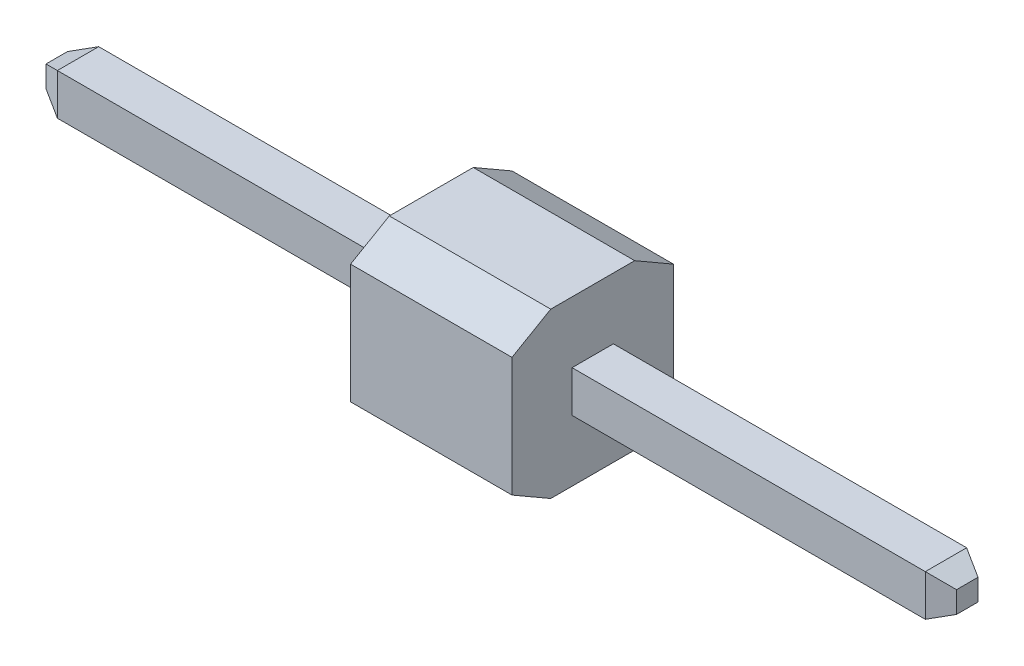
ISO-10303-21;
HEADER;
FILE_DESCRIPTION(('STEP AP214'),'2;1');
FILE_NAME('part.step','',(''),(''),'','','');
FILE_SCHEMA(('AUTOMOTIVE_DESIGN { 1 0 10303 214 1 1 1 1 }'));
ENDSEC;
DATA;
#1=APPLICATION_CONTEXT('core data for automotive mechanical design processes');
#2=APPLICATION_PROTOCOL_DEFINITION('international standard','automotive_design',2000,#1);
#3=PRODUCT_CONTEXT('',#1,'mechanical');
#4=PRODUCT('Part','Part','',(#3));
#5=PRODUCT_RELATED_PRODUCT_CATEGORY('part','',(#4));
#6=PRODUCT_DEFINITION_FORMATION('','',#4);
#7=PRODUCT_DEFINITION_CONTEXT('part definition',#1,'design');
#8=PRODUCT_DEFINITION('design','',#6,#7);
#9=PRODUCT_DEFINITION_SHAPE('','',#8);
#10=(LENGTH_UNIT() NAMED_UNIT(*) SI_UNIT(.MILLI.,.METRE.));
#11=(NAMED_UNIT(*) PLANE_ANGLE_UNIT() SI_UNIT($,.RADIAN.));
#12=(NAMED_UNIT(*) SI_UNIT($,.STERADIAN.) SOLID_ANGLE_UNIT());
#13=UNCERTAINTY_MEASURE_WITH_UNIT(LENGTH_MEASURE(1.E-05),#10,'distance_accuracy_value','');
#14=(GEOMETRIC_REPRESENTATION_CONTEXT(3) GLOBAL_UNCERTAINTY_ASSIGNED_CONTEXT((#13)) GLOBAL_UNIT_ASSIGNED_CONTEXT((#10,
#11,#12)) REPRESENTATION_CONTEXT('',''));
#15=CARTESIAN_POINT('',(0.,0.,0.));
#16=DIRECTION('',(0.,0.,1.));
#17=DIRECTION('',(1.,0.,0.));
#18=AXIS2_PLACEMENT_3D('',#15,#16,#17);
#19=CARTESIAN_POINT('',(5.42107514744054,-4.76288427394286,-2.77112015145706));
#20=DIRECTION('',(1.,-9.93476518829084E-08,4.37113882867379E-08));
#21=DIRECTION('',(-9.93476589883358E-08,-1.,8.74227765734759E-08));
#22=AXIS2_PLACEMENT_3D('',#19,#20,#21);
#23=PLANE('',#22);
#24=DIRECTION('',(-1.18186632778994E-08,-0.500000075710537,-0.866025360072935));
#25=VECTOR('',#24,1.);
#26=CARTESIAN_POINT('',(5.42107495526593,-6.00647397517509,-1.20112004273899));
#27=LINE('',#26,#25);
#28=CARTESIAN_POINT('',(5.42107495526593,-6.00647397517509,-1.20112004273899));
#29=VERTEX_POINT('',#28);
#30=CARTESIAN_POINT('',(5.42107494707772,-6.35288418914276,-1.80112001245485));
#31=VERTEX_POINT('',#30);
#32=EDGE_CURVE('E11',#29,#31,#27,.T.);
#33=ORIENTED_EDGE('',*,*,#32,.T.);
#34=DIRECTION('',(4.37113811813104E-08,-8.74227835422599E-08,-0.999999999999995));
#35=VECTOR('',#34,1.);
#36=CARTESIAN_POINT('',(5.42107494707772,-6.35288418914276,-1.80112001245485));
#37=LINE('',#36,#35);
#38=CARTESIAN_POINT('',(5.42107500390252,-6.35288430279238,-3.10112001245485));
#39=VERTEX_POINT('',#38);
#40=EDGE_CURVE('E304',#31,#39,#37,.T.);
#41=ORIENTED_EDGE('',*,*,#40,.T.);
#42=DIRECTION('',(8.75289963529268E-08,0.499999924289836,-0.866025447495713));
#43=VECTOR('',#42,1.);
#44=CARTESIAN_POINT('',(5.42107500390252,-6.35288430279238,-3.10112001245485));
#45=LINE('',#44,#43);
#46=CARTESIAN_POINT('',(5.42107506454438,-6.00647419373205,-3.70112004273898));
#47=VERTEX_POINT('',#46);
#48=EDGE_CURVE('E296',#39,#47,#45,.T.);
#49=ORIENTED_EDGE('',*,*,#48,.T.);
#50=DIRECTION('',(9.93476588435403E-08,0.999999999999991,-8.74227767225989E-08));
#51=VECTOR('',#50,1.);
#52=CARTESIAN_POINT('',(5.42107506454438,-6.00647419373205,-3.70112004273898));
#53=LINE('',#52,#51);
#54=CARTESIAN_POINT('',(5.42107524805736,-4.15929451676005,-3.70112020422456));
#55=VERTEX_POINT('',#54);
#56=EDGE_CURVE('E281',#47,#55,#53,.T.);
#57=ORIENTED_EDGE('',*,*,#56,.T.);
#58=DIRECTION('',(-1.18186632778994E-08,-0.500000075710538,-0.866025360072935));
#59=VECTOR('',#58,1.);
#60=CARTESIAN_POINT('',(5.42107525624557,-3.81288430279238,-3.1011202345087));
#61=LINE('',#60,#59);
#62=CARTESIAN_POINT('',(5.42107525624557,-3.81288430279238,-3.1011202345087));
#63=VERTEX_POINT('',#62);
#64=EDGE_CURVE('E265',#63,#55,#61,.T.);
#65=ORIENTED_EDGE('',*,*,#64,.F.);
#66=DIRECTION('',(4.37113811813104E-08,-8.74227828590458E-08,-0.999999999999995));
#67=VECTOR('',#66,1.);
#68=CARTESIAN_POINT('',(5.42107519942078,-3.81288418914276,-1.8011202345087));
#69=LINE('',#68,#67);
#70=CARTESIAN_POINT('',(5.42107519942078,-3.81288418914276,-1.8011202345087));
#71=VERTEX_POINT('',#70);
#72=EDGE_CURVE('E248',#71,#63,#69,.T.);
#73=ORIENTED_EDGE('',*,*,#72,.F.);
#74=DIRECTION('',(8.75289963529269E-08,0.499999924289835,-0.866025447495714));
#75=VECTOR('',#74,1.);
#76=CARTESIAN_POINT('',(5.42107513877891,-4.15929429820309,-1.20112020422456));
#77=LINE('',#76,#75);
#78=CARTESIAN_POINT('',(5.42107513877891,-4.15929429820309,-1.20112020422456));
#79=VERTEX_POINT('',#78);
#80=EDGE_CURVE('E242',#79,#71,#77,.T.);
#81=ORIENTED_EDGE('',*,*,#80,.F.);
#82=DIRECTION('',(9.93476588435403E-08,0.999999999999991,-8.74227763619768E-08));
#83=VECTOR('',#82,1.);
#84=CARTESIAN_POINT('',(5.42107495526593,-6.00647397517509,-1.20112004273899));
#85=LINE('',#84,#83);
#86=EDGE_CURVE('E236',#29,#79,#85,.T.);
#87=ORIENTED_EDGE('',*,*,#86,.F.);
#88=EDGE_LOOP('',(#33,#41,#49,#57,#65,#73,#81,#87));
#89=FACE_BOUND('',#88,.T.);
#90=DIRECTION('',(-4.37113817364219E-08,8.74227842895255E-08,0.999999999999995));
#91=VECTOR('',#90,1.);
#92=CARTESIAN_POINT('',(5.42107508385804,-5.40288427394286,-2.77112009550648));
#93=LINE('',#92,#91);
#94=CARTESIAN_POINT('',(5.42107508385804,-5.40288427394286,-2.77112009550648));
#95=VERTEX_POINT('',#94);
#96=CARTESIAN_POINT('',(5.42107505588275,-5.40288421799228,-2.13112009550648));
#97=VERTEX_POINT('',#96);
#98=EDGE_CURVE('E302',#95,#97,#93,.T.);
#99=ORIENTED_EDGE('',*,*,#98,.T.);
#100=DIRECTION('',(-9.93476592658907E-08,-0.999999999999991,8.74227759628525E-08));
#101=VECTOR('',#100,1.);
#102=CARTESIAN_POINT('',(5.42107511946525,-4.76288421799228,-2.13112015145706));
#103=LINE('',#102,#101);
#104=CARTESIAN_POINT('',(5.42107511946525,-4.76288421799228,-2.13112015145706));
#105=VERTEX_POINT('',#104);
#106=EDGE_CURVE('E293',#105,#97,#103,.T.);
#107=ORIENTED_EDGE('',*,*,#106,.F.);
#108=DIRECTION('',(-4.37113803486431E-08,8.74227842895254E-08,0.999999999999995));
#109=VECTOR('',#108,1.);
#110=CARTESIAN_POINT('',(5.42107514744054,-4.76288427394286,-2.77112015145706));
#111=LINE('',#110,#109);
#112=CARTESIAN_POINT('',(5.42107514744054,-4.76288427394286,-2.77112015145706));
#113=VERTEX_POINT('',#112);
#114=EDGE_CURVE('E278',#113,#105,#111,.T.);
#115=ORIENTED_EDGE('',*,*,#114,.F.);
#116=DIRECTION('',(-9.93476578781119E-08,-0.999999999999991,8.74227766567419E-08));
#117=VECTOR('',#116,1.);
#118=CARTESIAN_POINT('',(5.42107514744054,-4.76288427394286,-2.77112015145706));
#119=LINE('',#118,#117);
#120=EDGE_CURVE('E263',#113,#95,#119,.T.);
#121=ORIENTED_EDGE('',*,*,#120,.T.);
#122=EDGE_LOOP('',(#99,#107,#115,#121));
#123=FACE_BOUND('',#122,.T.);
#124=ADVANCED_FACE('F17',(#89,#123),#23,.T.);
#125=CARTESIAN_POINT('',(2.92107514744054,-4.76288402557373,-2.77112026073553));
#126=DIRECTION('',(1.,-9.93476518829084E-08,4.37113882867379E-08));
#127=DIRECTION('',(-9.93476589883358E-08,-1.,8.74227765734759E-08));
#128=AXIS2_PLACEMENT_3D('',#125,#126,#127);
#129=PLANE('',#128);
#130=DIRECTION('',(-1.18186626369119E-08,-0.500000075710537,-0.866025360072935));
#131=VECTOR('',#130,1.);
#132=CARTESIAN_POINT('',(2.92107495526593,-6.00647372680596,-1.20112015201746));
#133=LINE('',#132,#131);
#134=CARTESIAN_POINT('',(2.92107495526593,-6.00647372680596,-1.20112015201746));
#135=VERTEX_POINT('',#134);
#136=CARTESIAN_POINT('',(2.92107494707772,-6.35288394077363,-1.80112012173332));
#137=VERTEX_POINT('',#136);
#138=EDGE_CURVE('E24',#135,#137,#133,.T.);
#139=ORIENTED_EDGE('',*,*,#138,.F.);
#140=DIRECTION('',(9.9347659083955E-08,0.999999999999991,-8.74227763619768E-08));
#141=VECTOR('',#140,1.);
#142=CARTESIAN_POINT('',(2.92107495526593,-6.00647372680596,-1.20112015201746));
#143=LINE('',#142,#141);
#144=CARTESIAN_POINT('',(2.92107513877891,-4.15929404983396,-1.20112031350303));
#145=VERTEX_POINT('',#144);
#146=EDGE_CURVE('E300',#135,#145,#143,.T.);
#147=ORIENTED_EDGE('',*,*,#146,.T.);
#148=DIRECTION('',(8.75289957119393E-08,0.499999924289835,-0.866025447495714));
#149=VECTOR('',#148,1.);
#150=CARTESIAN_POINT('',(2.92107513877891,-4.15929404983396,-1.20112031350303));
#151=LINE('',#150,#149);
#152=CARTESIAN_POINT('',(2.92107519942077,-3.81288394077363,-1.80112034378717));
#153=VERTEX_POINT('',#152);
#154=EDGE_CURVE('E286',#145,#153,#151,.T.);
#155=ORIENTED_EDGE('',*,*,#154,.T.);
#156=DIRECTION('',(4.37113811813104E-08,-8.74227828590458E-08,-0.999999999999995));
#157=VECTOR('',#156,1.);
#158=CARTESIAN_POINT('',(2.92107519942077,-3.81288394077363,-1.80112034378717));
#159=LINE('',#158,#157);
#160=CARTESIAN_POINT('',(2.92107525624557,-3.81288405442325,-3.10112034378717));
#161=VERTEX_POINT('',#160);
#162=EDGE_CURVE('E271',#153,#161,#159,.T.);
#163=ORIENTED_EDGE('',*,*,#162,.T.);
#164=DIRECTION('',(-1.18186626369119E-08,-0.500000075710538,-0.866025360072935));
#165=VECTOR('',#164,1.);
#166=CARTESIAN_POINT('',(2.92107525624557,-3.81288405442325,-3.10112034378717));
#167=LINE('',#166,#165);
#168=CARTESIAN_POINT('',(2.92107524805736,-4.15929426839092,-3.70112031350303));
#169=VERTEX_POINT('',#168);
#170=EDGE_CURVE('E253',#161,#169,#167,.T.);
#171=ORIENTED_EDGE('',*,*,#170,.T.);
#172=DIRECTION('',(9.9347659083955E-08,0.999999999999991,-8.74227767225989E-08));
#173=VECTOR('',#172,1.);
#174=CARTESIAN_POINT('',(2.92107506454438,-6.00647394536292,-3.70112015201746));
#175=LINE('',#174,#173);
#176=CARTESIAN_POINT('',(2.92107506454438,-6.00647394536292,-3.70112015201746));
#177=VERTEX_POINT('',#176);
#178=EDGE_CURVE('E261',#177,#169,#175,.T.);
#179=ORIENTED_EDGE('',*,*,#178,.F.);
#180=DIRECTION('',(8.75289957119392E-08,0.499999924289836,-0.866025447495713));
#181=VECTOR('',#180,1.);
#182=CARTESIAN_POINT('',(2.92107500390252,-6.35288405442325,-3.10112012173332));
#183=LINE('',#182,#181);
#184=CARTESIAN_POINT('',(2.92107500390252,-6.35288405442325,-3.10112012173332));
#185=VERTEX_POINT('',#184);
#186=EDGE_CURVE('E276',#185,#177,#183,.T.);
#187=ORIENTED_EDGE('',*,*,#186,.F.);
#188=DIRECTION('',(4.37113811813104E-08,-8.74227835422599E-08,-0.999999999999995));
#189=VECTOR('',#188,1.);
#190=CARTESIAN_POINT('',(2.92107494707772,-6.35288394077363,-1.80112012173332));
#191=LINE('',#190,#189);
#192=EDGE_CURVE('E291',#137,#185,#191,.T.);
#193=ORIENTED_EDGE('',*,*,#192,.F.);
#194=EDGE_LOOP('',(#139,#147,#155,#163,#171,#179,#187,#193));
#195=FACE_BOUND('',#194,.T.);
#196=DIRECTION('',(-9.93476592658907E-08,-0.999999999999991,8.74227759628525E-08));
#197=VECTOR('',#196,1.);
#198=CARTESIAN_POINT('',(2.92107511946525,-4.76288396962315,-2.13112026073553));
#199=LINE('',#198,#197);
#200=CARTESIAN_POINT('',(2.92107511946525,-4.76288396962315,-2.13112026073553));
#201=VERTEX_POINT('',#200);
#202=CARTESIAN_POINT('',(2.92107505588275,-5.40288396962315,-2.13112020478496));
#203=VERTEX_POINT('',#202);
#204=EDGE_CURVE('E298',#201,#203,#199,.T.);
#205=ORIENTED_EDGE('',*,*,#204,.T.);
#206=DIRECTION('',(-4.37113810425325E-08,8.74227842895255E-08,0.999999999999995));
#207=VECTOR('',#206,1.);
#208=CARTESIAN_POINT('',(2.92107508385804,-5.40288402557373,-2.77112020478496));
#209=LINE('',#208,#207);
#210=CARTESIAN_POINT('',(2.92107508385804,-5.40288402557373,-2.77112020478496));
#211=VERTEX_POINT('',#210);
#212=EDGE_CURVE('E283',#211,#203,#209,.T.);
#213=ORIENTED_EDGE('',*,*,#212,.F.);
#214=DIRECTION('',(-9.93476592658907E-08,-0.999999999999991,8.74227766567419E-08));
#215=VECTOR('',#214,1.);
#216=CARTESIAN_POINT('',(2.92107514744054,-4.76288402557373,-2.77112026073553));
#217=LINE('',#216,#215);
#218=CARTESIAN_POINT('',(2.92107514744054,-4.76288402557373,-2.77112026073553));
#219=VERTEX_POINT('',#218);
#220=EDGE_CURVE('E268',#219,#211,#217,.T.);
#221=ORIENTED_EDGE('',*,*,#220,.F.);
#222=DIRECTION('',(-4.37113810425325E-08,8.74227842895254E-08,0.999999999999995));
#223=VECTOR('',#222,1.);
#224=CARTESIAN_POINT('',(2.92107514744054,-4.76288402557373,-2.77112026073553));
#225=LINE('',#224,#223);
#226=EDGE_CURVE('E251',#219,#201,#225,.T.);
#227=ORIENTED_EDGE('',*,*,#226,.T.);
#228=EDGE_LOOP('',(#205,#213,#221,#227));
#229=FACE_BOUND('',#228,.T.);
#230=ADVANCED_FACE('F314',(#195,#229),#129,.F.);
#231=CARTESIAN_POINT('',(5.42107495526593,-6.00647397517509,-1.20112004273899));
#232=DIRECTION('',(1.07893287081065E-07,0.866025360072937,-0.500000075710535));
#233=DIRECTION('',(1.18186629566715E-08,0.500000075710542,0.866025360072941));
#234=AXIS2_PLACEMENT_3D('',#231,#232,#233);
#235=PLANE('',#234);
#236=ORIENTED_EDGE('',*,*,#138,.T.);
#237=DIRECTION('',(-0.999999999999994,9.93476522381792E-08,-4.37113884643734E-08));
#238=VECTOR('',#237,1.);
#239=CARTESIAN_POINT('',(5.42107494707772,-6.35288418914276,-1.80112001245485));
#240=LINE('',#239,#238);
#241=EDGE_CURVE('E288',#31,#137,#240,.T.);
#242=ORIENTED_EDGE('',*,*,#241,.F.);
#243=ORIENTED_EDGE('',*,*,#32,.F.);
#244=DIRECTION('',(-0.999999999999994,9.93476525934505E-08,-4.3711388109102E-08));
#245=VECTOR('',#244,1.);
#246=CARTESIAN_POINT('',(5.42107495526593,-6.00647397517509,-1.20112004273899));
#247=LINE('',#246,#245);
#248=EDGE_CURVE('E256',#29,#135,#247,.T.);
#249=ORIENTED_EDGE('',*,*,#248,.T.);
#250=EDGE_LOOP('',(#236,#242,#243,#249));
#251=FACE_BOUND('',#250,.T.);
#252=ADVANCED_FACE('F306',(#251),#235,.F.);
#253=CARTESIAN_POINT('',(5.42107494707772,-6.35288418914276,-1.80112001245485));
#254=DIRECTION('',(9.93476589883358E-08,1.,-8.74227765734759E-08));
#255=DIRECTION('',(1.,-9.93476518829084E-08,4.37113882867379E-08));
#256=AXIS2_PLACEMENT_3D('',#253,#254,#255);
#257=PLANE('',#256);
#258=ORIENTED_EDGE('',*,*,#192,.T.);
#259=DIRECTION('',(-0.999999999999994,9.93476522381792E-08,-4.37113882867377E-08));
#260=VECTOR('',#259,1.);
#261=CARTESIAN_POINT('',(5.42107500390252,-6.35288430279238,-3.10112001245485));
#262=LINE('',#261,#260);
#263=EDGE_CURVE('E273',#39,#185,#262,.T.);
#264=ORIENTED_EDGE('',*,*,#263,.F.);
#265=ORIENTED_EDGE('',*,*,#40,.F.);
#266=ORIENTED_EDGE('',*,*,#241,.T.);
#267=EDGE_LOOP('',(#258,#264,#265,#266));
#268=FACE_BOUND('',#267,.T.);
#269=ADVANCED_FACE('F311',(#268),#257,.F.);
#270=CARTESIAN_POINT('',(5.42107500390252,-6.35288430279238,-3.10112001245485));
#271=DIRECTION('',(6.41819058997377E-08,0.866025447495721,0.499999924289845));
#272=DIRECTION('',(-8.7528996031702E-08,-0.499999924289838,0.866025447495717));
#273=AXIS2_PLACEMENT_3D('',#270,#271,#272);
#274=PLANE('',#273);
#275=ORIENTED_EDGE('',*,*,#186,.T.);
#276=DIRECTION('',(-0.999999999999994,9.93476525934505E-08,-4.37113884643734E-08));
#277=VECTOR('',#276,1.);
#278=CARTESIAN_POINT('',(5.42107506454438,-6.00647419373205,-3.70112004273898));
#279=LINE('',#278,#277);
#280=EDGE_CURVE('E258',#47,#177,#279,.T.);
#281=ORIENTED_EDGE('',*,*,#280,.F.);
#282=ORIENTED_EDGE('',*,*,#48,.F.);
#283=ORIENTED_EDGE('',*,*,#263,.T.);
#284=EDGE_LOOP('',(#275,#281,#282,#283));
#285=FACE_BOUND('',#284,.T.);
#286=ADVANCED_FACE('F319',(#285),#274,.F.);
#287=CARTESIAN_POINT('',(5.42107506454438,-6.00647419373205,-3.70112004273898));
#288=DIRECTION('',(-4.37113811813106E-08,8.74227836789032E-08,1.));
#289=DIRECTION('',(-1.,9.93476518829084E-08,-4.37113882867379E-08));
#290=AXIS2_PLACEMENT_3D('',#287,#288,#289);
#291=PLANE('',#290);
#292=ORIENTED_EDGE('',*,*,#178,.T.);
#293=DIRECTION('',(-0.999999999999994,9.93476518829078E-08,-4.37113882867377E-08));
#294=VECTOR('',#293,1.);
#295=CARTESIAN_POINT('',(5.42107524805736,-4.15929451676005,-3.70112020422456));
#296=LINE('',#295,#294);
#297=EDGE_CURVE('E245',#55,#169,#296,.T.);
#298=ORIENTED_EDGE('',*,*,#297,.F.);
#299=ORIENTED_EDGE('',*,*,#56,.F.);
#300=ORIENTED_EDGE('',*,*,#280,.T.);
#301=EDGE_LOOP('',(#292,#298,#299,#300));
#302=FACE_BOUND('',#301,.T.);
#303=ADVANCED_FACE('F326',(#302),#291,.F.);
#304=CARTESIAN_POINT('',(5.42107525624557,-3.81288430279238,-3.1011202345087));
#305=DIRECTION('',(1.07893287081065E-07,0.866025360072937,-0.500000075710535));
#306=DIRECTION('',(1.18186629566715E-08,0.500000075710542,0.866025360072941));
#307=AXIS2_PLACEMENT_3D('',#304,#305,#306);
#308=PLANE('',#307);
#309=ORIENTED_EDGE('',*,*,#170,.F.);
#310=DIRECTION('',(-0.999999999999994,9.93476518829078E-08,-4.37113884643734E-08));
#311=VECTOR('',#310,1.);
#312=CARTESIAN_POINT('',(5.42107525624557,-3.81288430279238,-3.1011202345087));
#313=LINE('',#312,#311);
#314=EDGE_CURVE('E239',#63,#161,#313,.T.);
#315=ORIENTED_EDGE('',*,*,#314,.F.);
#316=ORIENTED_EDGE('',*,*,#64,.T.);
#317=ORIENTED_EDGE('',*,*,#297,.T.);
#318=EDGE_LOOP('',(#309,#315,#316,#317));
#319=FACE_BOUND('',#318,.T.);
#320=ADVANCED_FACE('F329',(#319),#308,.T.);
#321=CARTESIAN_POINT('',(5.42107519942078,-3.81288418914276,-1.8011202345087));
#322=DIRECTION('',(9.93476589883358E-08,1.,-8.74227765734759E-08));
#323=DIRECTION('',(1.,-9.93476518829084E-08,4.37113882867379E-08));
#324=AXIS2_PLACEMENT_3D('',#321,#322,#323);
#325=PLANE('',#324);
#326=ORIENTED_EDGE('',*,*,#162,.F.);
#327=DIRECTION('',(-0.999999999999994,9.93476518829078E-08,-4.37113883755555E-08));
#328=VECTOR('',#327,1.);
#329=CARTESIAN_POINT('',(5.42107519942078,-3.81288418914276,-1.8011202345087));
#330=LINE('',#329,#328);
#331=EDGE_CURVE('E233',#71,#153,#330,.T.);
#332=ORIENTED_EDGE('',*,*,#331,.F.);
#333=ORIENTED_EDGE('',*,*,#72,.T.);
#334=ORIENTED_EDGE('',*,*,#314,.T.);
#335=EDGE_LOOP('',(#326,#332,#333,#334));
#336=FACE_BOUND('',#335,.T.);
#337=ADVANCED_FACE('F333',(#336),#325,.T.);
#338=CARTESIAN_POINT('',(5.42107513877891,-4.15929429820309,-1.20112020422456));
#339=DIRECTION('',(6.41819058997377E-08,0.866025447495721,0.499999924289845));
#340=DIRECTION('',(-8.7528996031702E-08,-0.499999924289838,0.866025447495717));
#341=AXIS2_PLACEMENT_3D('',#338,#339,#340);
#342=PLANE('',#341);
#343=ORIENTED_EDGE('',*,*,#154,.F.);
#344=DIRECTION('',(-0.999999999999994,9.93476518829078E-08,-4.3711388109102E-08));
#345=VECTOR('',#344,1.);
#346=CARTESIAN_POINT('',(5.42107513877891,-4.15929429820309,-1.20112020422456));
#347=LINE('',#346,#345);
#348=EDGE_CURVE('E230',#79,#145,#347,.T.);
#349=ORIENTED_EDGE('',*,*,#348,.F.);
#350=ORIENTED_EDGE('',*,*,#80,.T.);
#351=ORIENTED_EDGE('',*,*,#331,.T.);
#352=EDGE_LOOP('',(#343,#349,#350,#351));
#353=FACE_BOUND('',#352,.T.);
#354=ADVANCED_FACE('F337',(#353),#342,.T.);
#355=CARTESIAN_POINT('',(5.42107495526593,-6.00647397517509,-1.20112004273899));
#356=DIRECTION('',(-4.37113811813106E-08,8.74227835615132E-08,1.));
#357=DIRECTION('',(-9.93476589883358E-08,-1.,8.74227764560859E-08));
#358=AXIS2_PLACEMENT_3D('',#355,#356,#357);
#359=PLANE('',#358);
#360=ORIENTED_EDGE('',*,*,#146,.F.);
#361=ORIENTED_EDGE('',*,*,#248,.F.);
#362=ORIENTED_EDGE('',*,*,#86,.T.);
#363=ORIENTED_EDGE('',*,*,#348,.T.);
#364=EDGE_LOOP('',(#360,#361,#362,#363));
#365=FACE_BOUND('',#364,.T.);
#366=ADVANCED_FACE('F339',(#365),#359,.T.);
#367=CARTESIAN_POINT('',(-2.87892485255946,-4.76288344935735,-2.77112051426158));
#368=DIRECTION('',(-1.,9.93476518829084E-08,-4.37113882867379E-08));
#369=DIRECTION('',(9.93476589883358E-08,1.,-8.74227765734759E-08));
#370=AXIS2_PLACEMENT_3D('',#367,#368,#369);
#371=PLANE('',#370);
#372=DIRECTION('',(9.93476661653848E-08,0.999999999999991,-8.74227774760713E-08));
#373=VECTOR('',#372,1.);
#374=CARTESIAN_POINT('',(-2.8789249221031,-5.24900187966852,-2.28500199895476));
#375=LINE('',#374,#373);
#376=CARTESIAN_POINT('',(-2.8789249221031,-5.24900187966852,-2.28500199895476));
#377=VERTEX_POINT('',#376);
#378=CARTESIAN_POINT('',(-2.87892488909614,-4.91676493405052,-2.28500202799983));
#379=VERTEX_POINT('',#378);
#380=EDGE_CURVE('E228',#377,#379,#375,.T.);
#381=ORIENTED_EDGE('',*,*,#380,.T.);
#382=DIRECTION('',(4.37113793813867E-08,-8.74227828227278E-08,-0.999999999999995));
#383=VECTOR('',#382,1.);
#384=CARTESIAN_POINT('',(-2.87892488909614,-4.91676493405052,-2.28500202799983));
#385=LINE('',#384,#383);
#386=CARTESIAN_POINT('',(-2.87892487457361,-4.9167649630956,-2.61723897361783));
#387=VERTEX_POINT('',#386);
#388=EDGE_CURVE('E223',#379,#387,#385,.T.);
#389=ORIENTED_EDGE('',*,*,#388,.T.);
#390=DIRECTION('',(-9.9347660818728E-08,-0.999999999999991,8.74227774760711E-08));
#391=VECTOR('',#390,1.);
#392=CARTESIAN_POINT('',(-2.8789248745736,-4.9167649630956,-2.61723897361783));
#393=LINE('',#392,#391);
#394=CARTESIAN_POINT('',(-2.87892490758057,-5.2490019087136,-2.61723894457276));
#395=VERTEX_POINT('',#394);
#396=EDGE_CURVE('E215',#387,#395,#393,.T.);
#397=ORIENTED_EDGE('',*,*,#396,.T.);
#398=DIRECTION('',(-4.37113767080584E-08,8.74227801493995E-08,0.999999999999995));
#399=VECTOR('',#398,1.);
#400=CARTESIAN_POINT('',(-2.87892490758057,-5.2490019087136,-2.61723894457276));
#401=LINE('',#400,#399);
#402=EDGE_CURVE('E207',#395,#377,#401,.T.);
#403=ORIENTED_EDGE('',*,*,#402,.T.);
#404=EDGE_LOOP('',(#381,#389,#397,#403));
#405=FACE_BOUND('',#404,.T.);
#406=ADVANCED_FACE('F341',(#405),#371,.T.);
#407=CARTESIAN_POINT('',(-2.87892485255946,-4.76288344935735,-2.77112051426158));
#408=DIRECTION('',(9.93476589883358E-08,1.,-8.74227764510112E-08));
#409=DIRECTION('',(-4.37113811813106E-08,8.74227835564385E-08,1.));
#410=AXIS2_PLACEMENT_3D('',#407,#408,#409);
#411=PLANE('',#410);
#412=DIRECTION('',(0.999999999999994,-9.93476524284799E-08,4.37113882769953E-08));
#413=VECTOR('',#412,1.);
#414=CARTESIAN_POINT('',(-2.54892485255946,-4.76288348214207,-2.77112049983683));
#415=LINE('',#414,#413);
#416=CARTESIAN_POINT('',(-2.54892485255946,-4.76288348214207,-2.77112049983683));
#417=VERTEX_POINT('',#416);
#418=EDGE_CURVE('E225',#417,#219,#415,.T.);
#419=ORIENTED_EDGE('',*,*,#418,.F.);
#420=DIRECTION('',(-4.37113803486431E-08,8.74227842895254E-08,0.999999999999995));
#421=VECTOR('',#420,1.);
#422=CARTESIAN_POINT('',(-2.54892485255946,-4.76288348214207,-2.77112049983683));
#423=LINE('',#422,#421);
#424=CARTESIAN_POINT('',(-2.54892488053475,-4.76288342619149,-2.13112049983683));
#425=VERTEX_POINT('',#424);
#426=EDGE_CURVE('E217',#417,#425,#423,.T.);
#427=ORIENTED_EDGE('',*,*,#426,.T.);
#428=DIRECTION('',(0.999999999999994,-9.93476524284799E-08,4.3711388195809E-08));
#429=VECTOR('',#428,1.);
#430=CARTESIAN_POINT('',(-2.54892488053475,-4.76288342619149,-2.13112049983683));
#431=LINE('',#430,#429);
#432=EDGE_CURVE('E220',#425,#201,#431,.T.);
#433=ORIENTED_EDGE('',*,*,#432,.T.);
#434=ORIENTED_EDGE('',*,*,#226,.F.);
#435=EDGE_LOOP('',(#419,#427,#433,#434));
#436=FACE_BOUND('',#435,.T.);
#437=ADVANCED_FACE('F348',(#436),#411,.T.);
#438=CARTESIAN_POINT('',(-2.87892488053475,-4.76288339340677,-2.13112051426158));
#439=DIRECTION('',(-4.37113811813106E-08,8.74227836789032E-08,1.));
#440=DIRECTION('',(-1.,9.93476518829084E-08,-4.37113882867379E-08));
#441=AXIS2_PLACEMENT_3D('',#438,#439,#440);
#442=PLANE('',#441);
#443=ORIENTED_EDGE('',*,*,#432,.F.);
#444=DIRECTION('',(-9.93476592658907E-08,-0.999999999999991,8.74227766567419E-08));
#445=VECTOR('',#444,1.);
#446=CARTESIAN_POINT('',(-2.54892488053475,-4.76288342619149,-2.13112049983683));
#447=LINE('',#446,#445);
#448=CARTESIAN_POINT('',(-2.54892494411725,-5.40288342619149,-2.13112044388625));
#449=VERTEX_POINT('',#448);
#450=EDGE_CURVE('E209',#425,#449,#447,.T.);
#451=ORIENTED_EDGE('',*,*,#450,.T.);
#452=DIRECTION('',(0.999999999999994,-9.93476512918714E-08,4.3711388195809E-08));
#453=VECTOR('',#452,1.);
#454=CARTESIAN_POINT('',(-2.54892494411725,-5.40288342619149,-2.13112044388625));
#455=LINE('',#454,#453);
#456=EDGE_CURVE('E212',#449,#203,#455,.T.);
#457=ORIENTED_EDGE('',*,*,#456,.T.);
#458=ORIENTED_EDGE('',*,*,#204,.F.);
#459=EDGE_LOOP('',(#443,#451,#457,#458));
#460=FACE_BOUND('',#459,.T.);
#461=ADVANCED_FACE('F424',(#460),#442,.T.);
#462=CARTESIAN_POINT('',(-2.87892491614196,-5.40288344935735,-2.77112045831101));
#463=DIRECTION('',(9.93476589883357E-08,1.,-8.74227764040693E-08));
#464=DIRECTION('',(-4.37113811813106E-08,8.74227835094966E-08,1.));
#465=AXIS2_PLACEMENT_3D('',#462,#463,#464);
#466=PLANE('',#465);
#467=ORIENTED_EDGE('',*,*,#456,.F.);
#468=DIRECTION('',(4.37113831242006E-08,-8.7422787065083E-08,-0.999999999999995));
#469=VECTOR('',#468,1.);
#470=CARTESIAN_POINT('',(-2.54892494411725,-5.40288342619149,-2.13112044388625));
#471=LINE('',#470,#469);
#472=CARTESIAN_POINT('',(-2.54892491614196,-5.40288348214207,-2.77112044388625));
#473=VERTEX_POINT('',#472);
#474=EDGE_CURVE('E201',#449,#473,#471,.T.);
#475=ORIENTED_EDGE('',*,*,#474,.T.);
#476=DIRECTION('',(0.999999999999994,-9.93476512918714E-08,4.37113882769953E-08));
#477=VECTOR('',#476,1.);
#478=CARTESIAN_POINT('',(-2.54892491614196,-5.40288348214207,-2.77112044388625));
#479=LINE('',#478,#477);
#480=EDGE_CURVE('E204',#473,#211,#479,.T.);
#481=ORIENTED_EDGE('',*,*,#480,.T.);
#482=ORIENTED_EDGE('',*,*,#212,.T.);
#483=EDGE_LOOP('',(#467,#475,#481,#482));
#484=FACE_BOUND('',#483,.T.);
#485=ADVANCED_FACE('F421',(#484),#466,.F.);
#486=CARTESIAN_POINT('',(-2.87892485255946,-4.76288344935735,-2.77112051426158));
#487=DIRECTION('',(-4.37113811813106E-08,8.74227836789032E-08,1.));
#488=DIRECTION('',(-1.,9.93476518829084E-08,-4.37113882867379E-08));
#489=AXIS2_PLACEMENT_3D('',#486,#487,#488);
#490=PLANE('',#489);
#491=ORIENTED_EDGE('',*,*,#480,.F.);
#492=DIRECTION('',(9.9347659265891E-08,0.999999999999991,-8.74227766567421E-08));
#493=VECTOR('',#492,1.);
#494=CARTESIAN_POINT('',(-2.54892491614196,-5.40288348214207,-2.77112044388625));
#495=LINE('',#494,#493);
#496=EDGE_CURVE('E196',#473,#417,#495,.T.);
#497=ORIENTED_EDGE('',*,*,#496,.T.);
#498=ORIENTED_EDGE('',*,*,#418,.T.);
#499=ORIENTED_EDGE('',*,*,#220,.T.);
#500=EDGE_LOOP('',(#491,#497,#498,#499));
#501=FACE_BOUND('',#500,.T.);
#502=ADVANCED_FACE('F376',(#501),#490,.F.);
#503=CARTESIAN_POINT('',(-2.87892485255946,-4.76288344935735,-2.77112051426158));
#504=DIRECTION('',(-4.37113811813106E-08,8.74227836789032E-08,1.));
#505=DIRECTION('',(-1.,9.93476518829084E-08,-4.37113882867379E-08));
#506=AXIS2_PLACEMENT_3D('',#503,#504,#505);
#507=PLANE('',#506);
#508=DIRECTION('',(0.999999999999994,-9.93476545393245E-08,4.37113882769953E-08));
#509=VECTOR('',#508,1.);
#510=CARTESIAN_POINT('',(5.42107514744054,-4.76288427394286,-2.77112015145706));
#511=LINE('',#510,#509);
#512=CARTESIAN_POINT('',(10.8910751474405,-4.76288481737452,-2.77111991235577));
#513=VERTEX_POINT('',#512);
#514=EDGE_CURVE('E199',#113,#513,#511,.T.);
#515=ORIENTED_EDGE('',*,*,#514,.T.);
#516=DIRECTION('',(-9.93476606536695E-08,-0.999999999999991,8.74227766567419E-08));
#517=VECTOR('',#516,1.);
#518=CARTESIAN_POINT('',(10.8910751474405,-4.76288481737452,-2.77111991235577));
#519=LINE('',#518,#517);
#520=CARTESIAN_POINT('',(10.891075083858,-5.40288481737452,-2.77111985640519));
#521=VERTEX_POINT('',#520);
#522=EDGE_CURVE('E191',#513,#521,#519,.T.);
#523=ORIENTED_EDGE('',*,*,#522,.T.);
#524=DIRECTION('',(0.999999999999994,-9.93476545393245E-08,4.37113882769953E-08));
#525=VECTOR('',#524,1.);
#526=CARTESIAN_POINT('',(5.42107508385804,-5.40288427394286,-2.77112009550648));
#527=LINE('',#526,#525);
#528=EDGE_CURVE('E194',#95,#521,#527,.T.);
#529=ORIENTED_EDGE('',*,*,#528,.F.);
#530=ORIENTED_EDGE('',*,*,#120,.F.);
#531=EDGE_LOOP('',(#515,#523,#529,#530));
#532=FACE_BOUND('',#531,.T.);
#533=ADVANCED_FACE('F367',(#532),#507,.F.);
#534=CARTESIAN_POINT('',(-2.87892491614196,-5.40288344935735,-2.77112045831101));
#535=DIRECTION('',(9.93476589883357E-08,1.,-8.74227764040693E-08));
#536=DIRECTION('',(-4.37113811813106E-08,8.74227835094966E-08,1.));
#537=AXIS2_PLACEMENT_3D('',#534,#535,#536);
#538=PLANE('',#537);
#539=ORIENTED_EDGE('',*,*,#528,.T.);
#540=DIRECTION('',(-4.37113845119794E-08,8.74227842895254E-08,0.999999999999995));
#541=VECTOR('',#540,1.);
#542=CARTESIAN_POINT('',(10.891075083858,-5.40288481737452,-2.77111985640519));
#543=LINE('',#542,#541);
#544=CARTESIAN_POINT('',(10.8910750558828,-5.40288476142393,-2.13111985640519));
#545=VERTEX_POINT('',#544);
#546=EDGE_CURVE('E186',#521,#545,#543,.T.);
#547=ORIENTED_EDGE('',*,*,#546,.T.);
#548=DIRECTION('',(0.999999999999994,-9.93476545393245E-08,4.37113881146227E-08));
#549=VECTOR('',#548,1.);
#550=CARTESIAN_POINT('',(5.42107505588275,-5.40288421799227,-2.13112009550648));
#551=LINE('',#550,#549);
#552=EDGE_CURVE('E189',#97,#545,#551,.T.);
#553=ORIENTED_EDGE('',*,*,#552,.F.);
#554=ORIENTED_EDGE('',*,*,#98,.F.);
#555=EDGE_LOOP('',(#539,#547,#553,#554));
#556=FACE_BOUND('',#555,.T.);
#557=ADVANCED_FACE('F364',(#556),#538,.F.);
#558=CARTESIAN_POINT('',(-2.87892488053475,-4.76288339340677,-2.13112051426158));
#559=DIRECTION('',(-4.37113811813106E-08,8.74227836789032E-08,1.));
#560=DIRECTION('',(-1.,9.93476518829084E-08,-4.37113882867379E-08));
#561=AXIS2_PLACEMENT_3D('',#558,#559,#560);
#562=PLANE('',#561);
#563=ORIENTED_EDGE('',*,*,#552,.T.);
#564=DIRECTION('',(9.93476578781122E-08,0.999999999999991,-8.74227759628527E-08));
#565=VECTOR('',#564,1.);
#566=CARTESIAN_POINT('',(10.8910750558828,-5.40288476142393,-2.13111985640519));
#567=LINE('',#566,#565);
#568=CARTESIAN_POINT('',(10.8910751194653,-4.76288476142393,-2.13111991235577));
#569=VERTEX_POINT('',#568);
#570=EDGE_CURVE('E176',#545,#569,#567,.T.);
#571=ORIENTED_EDGE('',*,*,#570,.T.);
#572=DIRECTION('',(0.999999999999994,-9.93476545393245E-08,4.37113881146227E-08));
#573=VECTOR('',#572,1.);
#574=CARTESIAN_POINT('',(5.42107511946525,-4.76288421799227,-2.13112015145706));
#575=LINE('',#574,#573);
#576=EDGE_CURVE('E179',#105,#569,#575,.T.);
#577=ORIENTED_EDGE('',*,*,#576,.F.);
#578=ORIENTED_EDGE('',*,*,#106,.T.);
#579=EDGE_LOOP('',(#563,#571,#577,#578));
#580=FACE_BOUND('',#579,.T.);
#581=ADVANCED_FACE('F366',(#580),#562,.T.);
#582=CARTESIAN_POINT('',(-2.87892485255946,-4.76288344935735,-2.77112051426158));
#583=DIRECTION('',(9.93476589883358E-08,1.,-8.74227764510112E-08));
#584=DIRECTION('',(-4.37113811813106E-08,8.74227835564385E-08,1.));
#585=AXIS2_PLACEMENT_3D('',#582,#583,#584);
#586=PLANE('',#585);
#587=ORIENTED_EDGE('',*,*,#576,.T.);
#588=DIRECTION('',(4.37113789608643E-08,-8.74227842895254E-08,-0.999999999999995));
#589=VECTOR('',#588,1.);
#590=CARTESIAN_POINT('',(10.8910751194653,-4.76288476142393,-2.13111991235577));
#591=LINE('',#590,#589);
#592=EDGE_CURVE('E167',#569,#513,#591,.T.);
#593=ORIENTED_EDGE('',*,*,#592,.T.);
#594=ORIENTED_EDGE('',*,*,#514,.F.);
#595=ORIENTED_EDGE('',*,*,#114,.T.);
#596=EDGE_LOOP('',(#587,#593,#594,#595));
#597=FACE_BOUND('',#596,.T.);
#598=ADVANCED_FACE('F373',(#597),#586,.T.);
#599=CARTESIAN_POINT('',(11.2210751474405,-4.76288485015924,-2.77111989793101));
#600=DIRECTION('',(-1.,9.93476518829084E-08,-4.37113882867379E-08));
#601=DIRECTION('',(9.93476589883358E-08,1.,-8.74227765734759E-08));
#602=AXIS2_PLACEMENT_3D('',#599,#600,#601);
#603=PLANE('',#602);
#604=DIRECTION('',(-9.93476581453997E-08,-0.999999999999991,8.7422776139407E-08));
#605=VECTOR('',#604,1.);
#606=CARTESIAN_POINT('',(11.2210751109039,-4.91676633485241,-2.28500141166926));
#607=LINE('',#606,#605);
#608=CARTESIAN_POINT('',(11.2210751109039,-4.91676633485241,-2.28500141166926));
#609=VERTEX_POINT('',#608);
#610=CARTESIAN_POINT('',(11.2210750778969,-5.24900328047041,-2.28500138262418));
#611=VERTEX_POINT('',#610);
#612=EDGE_CURVE('E153',#609,#611,#607,.T.);
#613=ORIENTED_EDGE('',*,*,#612,.T.);
#614=DIRECTION('',(4.37113820547149E-08,-8.74227828227278E-08,-0.999999999999995));
#615=VECTOR('',#614,1.);
#616=CARTESIAN_POINT('',(11.2210750778969,-5.24900328047041,-2.28500138262418));
#617=LINE('',#616,#615);
#618=CARTESIAN_POINT('',(11.2210750924194,-5.24900330951549,-2.61723832824218));
#619=VERTEX_POINT('',#618);
#620=EDGE_CURVE('E395',#611,#619,#617,.T.);
#621=ORIENTED_EDGE('',*,*,#620,.T.);
#622=DIRECTION('',(9.93476527987434E-08,0.999999999999991,-8.74227761394072E-08));
#623=VECTOR('',#622,1.);
#624=CARTESIAN_POINT('',(11.2210750924194,-5.24900330951549,-2.61723832824218));
#625=LINE('',#624,#623);
#626=CARTESIAN_POINT('',(11.2210751254264,-4.91676636389749,-2.61723835728726));
#627=VERTEX_POINT('',#626);
#628=EDGE_CURVE('E156',#619,#627,#625,.T.);
#629=ORIENTED_EDGE('',*,*,#628,.T.);
#630=DIRECTION('',(-4.37113874013715E-08,8.74227774760712E-08,0.999999999999995));
#631=VECTOR('',#630,1.);
#632=CARTESIAN_POINT('',(11.2210751254264,-4.91676636389749,-2.61723835728726));
#633=LINE('',#632,#631);
#634=EDGE_CURVE('E149',#627,#609,#633,.T.);
#635=ORIENTED_EDGE('',*,*,#634,.T.);
#636=EDGE_LOOP('',(#613,#621,#629,#635));
#637=FACE_BOUND('',#636,.T.);
#638=ADVANCED_FACE('F151',(#637),#603,.F.);
#639=CARTESIAN_POINT('',(-2.87892490085419,-5.24900192216635,-2.77112047176376));
#640=DIRECTION('',(-0.422618351780369,-0.906307745050466,6.07587120833484E-08));
#641=DIRECTION('',(4.37113811813106E-08,-8.74227835094966E-08,-1.));
#642=AXIS2_PLACEMENT_3D('',#639,#640,#641);
#643=PLANE('',#642);
#644=DIRECTION('',(0.83481707378875,-0.389281669540041,0.389281691158097));
#645=VECTOR('',#644,1.);
#646=CARTESIAN_POINT('',(-2.8789249221028,-5.24900187966819,-2.28500199895509));
#647=LINE('',#646,#645);
#648=EDGE_CURVE('E181',#377,#449,#647,.T.);
#649=ORIENTED_EDGE('',*,*,#648,.F.);
#650=ORIENTED_EDGE('',*,*,#402,.F.);
#651=DIRECTION('',(-0.834817107820824,0.389281737604202,0.389281550111906));
#652=VECTOR('',#651,1.);
#653=CARTESIAN_POINT('',(-2.54892491614174,-5.40288348214184,-2.77112044388601));
#654=LINE('',#653,#652);
#655=EDGE_CURVE('E404',#473,#395,#654,.T.);
#656=ORIENTED_EDGE('',*,*,#655,.F.);
#657=ORIENTED_EDGE('',*,*,#474,.F.);
#658=EDGE_LOOP('',(#649,#650,#656,#657));
#659=FACE_BOUND('',#658,.T.);
#660=ADVANCED_FACE('F418',(#659),#643,.T.);
#661=CARTESIAN_POINT('',(-2.87892485928584,-4.7628834359046,-2.61723898707058));
#662=DIRECTION('',(-0.422618222124847,-3.72458176658199E-08,-0.906307805509828));
#663=DIRECTION('',(9.93476589883358E-08,1.,-8.74227765734759E-08));
#664=AXIS2_PLACEMENT_3D('',#661,#662,#663);
#665=PLANE('',#664);
#666=ORIENTED_EDGE('',*,*,#655,.T.);
#667=ORIENTED_EDGE('',*,*,#396,.F.);
#668=DIRECTION('',(-0.834817185169257,-0.389281503665794,0.389281618176065));
#669=VECTOR('',#668,1.);
#670=CARTESIAN_POINT('',(-2.54892485255929,-4.76288348214226,-2.77112049983664));
#671=LINE('',#670,#669);
#672=EDGE_CURVE('E160',#417,#387,#671,.T.);
#673=ORIENTED_EDGE('',*,*,#672,.F.);
#674=ORIENTED_EDGE('',*,*,#496,.F.);
#675=EDGE_LOOP('',(#666,#667,#673,#674));
#676=FACE_BOUND('',#675,.T.);
#677=ADVANCED_FACE('F434',(#676),#665,.T.);
#678=CARTESIAN_POINT('',(-2.54892488053475,-4.76288342619149,-2.13112049983683));
#679=DIRECTION('',(0.422618301356777,-1.21218081559392E-07,-0.906307768563367));
#680=DIRECTION('',(-9.93476589883358E-08,-1.,8.74227765734759E-08));
#681=AXIS2_PLACEMENT_3D('',#678,#679,#680);
#682=PLANE('',#681);
#683=ORIENTED_EDGE('',*,*,#648,.T.);
#684=ORIENTED_EDGE('',*,*,#450,.F.);
#685=DIRECTION('',(0.83481715113718,0.389281571729966,0.389281623093936));
#686=VECTOR('',#685,1.);
#687=CARTESIAN_POINT('',(-2.87892488909605,-4.91676493405062,-2.28500202799993));
#688=LINE('',#687,#686);
#689=EDGE_CURVE('E170',#379,#425,#688,.T.);
#690=ORIENTED_EDGE('',*,*,#689,.F.);
#691=ORIENTED_EDGE('',*,*,#380,.F.);
#692=EDGE_LOOP('',(#683,#684,#690,#691));
#693=FACE_BOUND('',#692,.T.);
#694=ADVANCED_FACE('F413',(#693),#682,.F.);
#695=CARTESIAN_POINT('',(-2.54892485255946,-4.76288348214207,-2.77112049983683));
#696=DIRECTION('',(0.422618171701255,-0.906307829022729,9.770517399793E-08));
#697=DIRECTION('',(-4.37113811813106E-08,8.74227835564385E-08,1.));
#698=AXIS2_PLACEMENT_3D('',#695,#696,#697);
#699=PLANE('',#698);
#700=ORIENTED_EDGE('',*,*,#672,.T.);
#701=ORIENTED_EDGE('',*,*,#388,.F.);
#702=ORIENTED_EDGE('',*,*,#689,.T.);
#703=ORIENTED_EDGE('',*,*,#426,.F.);
#704=EDGE_LOOP('',(#700,#701,#702,#703));
#705=FACE_BOUND('',#704,.T.);
#706=ADVANCED_FACE('F429',(#705),#699,.F.);
#707=CARTESIAN_POINT('',(11.2210751321528,-4.91676637735024,-2.77111988447826));
#708=DIRECTION('',(0.422618351780369,0.906307745050466,-6.07587121258922E-08));
#709=DIRECTION('',(4.37113811813106E-08,-8.74227835564385E-08,-1.));
#710=AXIS2_PLACEMENT_3D('',#707,#708,#709);
#711=PLANE('',#710);
#712=DIRECTION('',(-0.83481710782082,0.389281737604208,0.389281550111907));
#713=VECTOR('',#712,1.);
#714=CARTESIAN_POINT('',(11.2210751109036,-4.91676633485274,-2.28500141166959));
#715=LINE('',#714,#713);
#716=EDGE_CURVE('E164',#609,#569,#715,.T.);
#717=ORIENTED_EDGE('',*,*,#716,.F.);
#718=ORIENTED_EDGE('',*,*,#634,.F.);
#719=DIRECTION('',(0.83481707378875,-0.389281669540038,0.389281691158098));
#720=VECTOR('',#719,1.);
#721=CARTESIAN_POINT('',(10.8910751474405,-4.76288481737452,-2.77111991235577));
#722=LINE('',#721,#720);
#723=EDGE_CURVE('E392',#513,#627,#722,.T.);
#724=ORIENTED_EDGE('',*,*,#723,.F.);
#725=ORIENTED_EDGE('',*,*,#592,.F.);
#726=EDGE_LOOP('',(#717,#718,#724,#725));
#727=FACE_BOUND('',#726,.T.);
#728=ADVANCED_FACE('F165',(#727),#711,.T.);
#729=CARTESIAN_POINT('',(10.8910751474405,-4.76288481737452,-2.77111991235577));
#730=DIRECTION('',(-0.422618301356777,1.21218081559392E-07,0.906307768563367));
#731=DIRECTION('',(-9.93476589883358E-08,-1.,8.74227765734759E-08));
#732=AXIS2_PLACEMENT_3D('',#729,#730,#731);
#733=PLANE('',#732);
#734=ORIENTED_EDGE('',*,*,#723,.T.);
#735=ORIENTED_EDGE('',*,*,#628,.F.);
#736=DIRECTION('',(0.834817151137184,0.389281571729958,0.389281623093935));
#737=VECTOR('',#736,1.);
#738=CARTESIAN_POINT('',(10.891075083858,-5.40288481737448,-2.77111985640505));
#739=LINE('',#738,#737);
#740=EDGE_CURVE('E389',#521,#619,#739,.T.);
#741=ORIENTED_EDGE('',*,*,#740,.F.);
#742=ORIENTED_EDGE('',*,*,#522,.F.);
#743=EDGE_LOOP('',(#734,#735,#741,#742));
#744=FACE_BOUND('',#743,.T.);
#745=ADVANCED_FACE('F390',(#744),#733,.F.);
#746=CARTESIAN_POINT('',(11.2210751261916,-4.76288480766141,-2.28500142512201));
#747=DIRECTION('',(0.422618222124847,3.72458176658199E-08,0.906307805509828));
#748=DIRECTION('',(9.93476589883358E-08,1.,-8.74227765734759E-08));
#749=AXIS2_PLACEMENT_3D('',#746,#747,#748);
#750=PLANE('',#749);
#751=ORIENTED_EDGE('',*,*,#716,.T.);
#752=ORIENTED_EDGE('',*,*,#570,.F.);
#753=DIRECTION('',(-0.834817185169257,-0.389281503665794,0.389281618176065));
#754=VECTOR('',#753,1.);
#755=CARTESIAN_POINT('',(11.2210750778966,-5.24900328047008,-2.28500138262451));
#756=LINE('',#755,#754);
#757=EDGE_CURVE('E175',#611,#545,#756,.T.);
#758=ORIENTED_EDGE('',*,*,#757,.F.);
#759=ORIENTED_EDGE('',*,*,#612,.F.);
#760=EDGE_LOOP('',(#751,#752,#758,#759));
#761=FACE_BOUND('',#760,.T.);
#762=ADVANCED_FACE('F173',(#761),#750,.T.);
#763=CARTESIAN_POINT('',(10.891075083858,-5.40288481737452,-2.77111985640519));
#764=DIRECTION('',(-0.422618171701255,0.906307829022729,-9.77051739553862E-08));
#765=DIRECTION('',(-4.37113811813106E-08,8.74227835094966E-08,1.));
#766=AXIS2_PLACEMENT_3D('',#763,#764,#765);
#767=PLANE('',#766);
#768=ORIENTED_EDGE('',*,*,#740,.T.);
#769=ORIENTED_EDGE('',*,*,#620,.F.);
#770=ORIENTED_EDGE('',*,*,#757,.T.);
#771=ORIENTED_EDGE('',*,*,#546,.F.);
#772=EDGE_LOOP('',(#768,#769,#770,#771));
#773=FACE_BOUND('',#772,.T.);
#774=ADVANCED_FACE('F394',(#773),#767,.F.);
#775=CLOSED_SHELL('',(#124,#230,#252,#269,#286,#303,#320,#337,#354,#366,#406,#437,#461,#485,
#502,#533,#557,#581,#598,#638,#660,#677,#694,#706,#728,#745,#762,#774));
#776=MANIFOLD_SOLID_BREP('B1',#775);
#777=ADVANCED_BREP_SHAPE_REPRESENTATION('',(#18,#776),#14);
#778=SHAPE_DEFINITION_REPRESENTATION(#9,#777);
ENDSEC;
END-ISO-10303-21;
